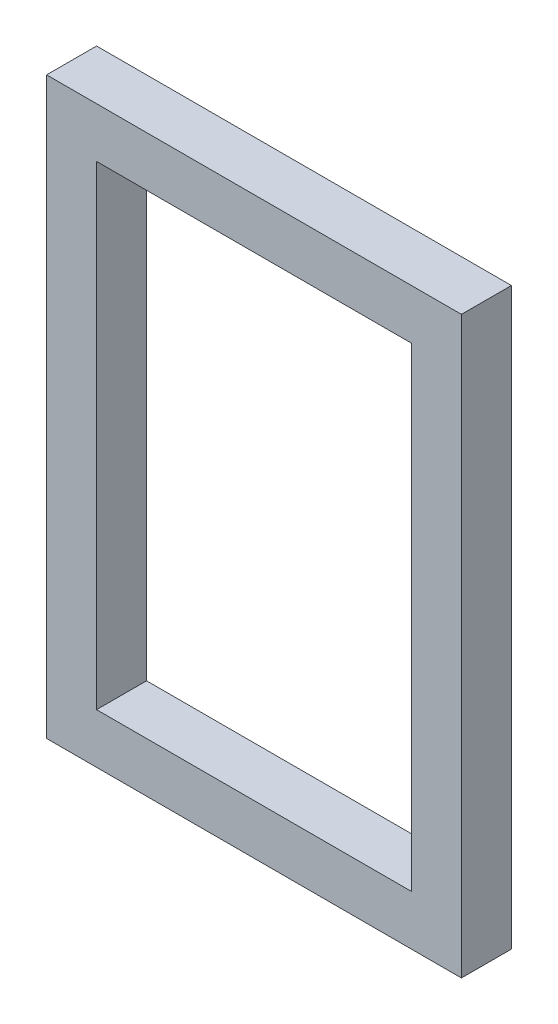
ISO-10303-21;
HEADER;
FILE_DESCRIPTION(('STEP AP214'),'2;1');
FILE_NAME('part.step','',(''),(''),'','','');
FILE_SCHEMA(('AUTOMOTIVE_DESIGN { 1 0 10303 214 1 1 1 1 }'));
ENDSEC;
DATA;
#1=APPLICATION_CONTEXT('core data for automotive mechanical design processes');
#2=APPLICATION_PROTOCOL_DEFINITION('international standard','automotive_design',2000,#1);
#3=PRODUCT_CONTEXT('',#1,'mechanical');
#4=PRODUCT('Part','Part','',(#3));
#5=PRODUCT_RELATED_PRODUCT_CATEGORY('part','',(#4));
#6=PRODUCT_DEFINITION_FORMATION('','',#4);
#7=PRODUCT_DEFINITION_CONTEXT('part definition',#1,'design');
#8=PRODUCT_DEFINITION('design','',#6,#7);
#9=PRODUCT_DEFINITION_SHAPE('','',#8);
#10=(LENGTH_UNIT() NAMED_UNIT(*) SI_UNIT(.MILLI.,.METRE.));
#11=(NAMED_UNIT(*) PLANE_ANGLE_UNIT() SI_UNIT($,.RADIAN.));
#12=(NAMED_UNIT(*) SI_UNIT($,.STERADIAN.) SOLID_ANGLE_UNIT());
#13=UNCERTAINTY_MEASURE_WITH_UNIT(LENGTH_MEASURE(1.E-05),#10,'distance_accuracy_value','');
#14=(GEOMETRIC_REPRESENTATION_CONTEXT(3) GLOBAL_UNCERTAINTY_ASSIGNED_CONTEXT((#13)) GLOBAL_UNIT_ASSIGNED_CONTEXT((#10,
#11,#12)) REPRESENTATION_CONTEXT('',''));
#15=CARTESIAN_POINT('',(0.,0.,0.));
#16=DIRECTION('',(0.,0.,1.));
#17=DIRECTION('',(1.,0.,0.));
#18=AXIS2_PLACEMENT_3D('',#15,#16,#17);
#19=CARTESIAN_POINT('',(10.541,-14.605,2.54));
#20=DIRECTION('',(-1.,0.,0.));
#21=DIRECTION('',(0.,0.,1.));
#22=AXIS2_PLACEMENT_3D('',#19,#20,#21);
#23=PLANE('',#22);
#24=DIRECTION('',(0.,1.,0.));
#25=VECTOR('',#24,1.);
#26=CARTESIAN_POINT('',(10.541,-14.605,0.));
#27=LINE('',#26,#25);
#28=CARTESIAN_POINT('',(10.541,-14.605,0.));
#29=VERTEX_POINT('',#28);
#30=CARTESIAN_POINT('',(10.541,14.605,0.));
#31=VERTEX_POINT('',#30);
#32=EDGE_CURVE('E153',#29,#31,#27,.T.);
#33=ORIENTED_EDGE('',*,*,#32,.T.);
#34=DIRECTION('',(0.,0.,-1.));
#35=VECTOR('',#34,1.);
#36=CARTESIAN_POINT('',(10.541,14.605,2.54));
#37=LINE('',#36,#35);
#38=CARTESIAN_POINT('',(10.541,14.605,2.54));
#39=VERTEX_POINT('',#38);
#40=EDGE_CURVE('E11',#39,#31,#37,.T.);
#41=ORIENTED_EDGE('',*,*,#40,.F.);
#42=DIRECTION('',(0.,1.,0.));
#43=VECTOR('',#42,1.);
#44=CARTESIAN_POINT('',(10.541,-14.605,2.54));
#45=LINE('',#44,#43);
#46=CARTESIAN_POINT('',(10.541,-14.605,2.54));
#47=VERTEX_POINT('',#46);
#48=EDGE_CURVE('E159',#47,#39,#45,.T.);
#49=ORIENTED_EDGE('',*,*,#48,.F.);
#50=DIRECTION('',(0.,0.,-1.));
#51=VECTOR('',#50,1.);
#52=CARTESIAN_POINT('',(10.541,-14.605,2.54));
#53=LINE('',#52,#51);
#54=EDGE_CURVE('E173',#47,#29,#53,.T.);
#55=ORIENTED_EDGE('',*,*,#54,.T.);
#56=EDGE_LOOP('',(#33,#41,#49,#55));
#57=FACE_BOUND('',#56,.T.);
#58=ADVANCED_FACE('F44',(#57),#23,.F.);
#59=CARTESIAN_POINT('',(-10.541,14.605,2.54));
#60=DIRECTION('',(0.,-1.,0.));
#61=DIRECTION('',(0.,0.,-1.));
#62=AXIS2_PLACEMENT_3D('',#59,#60,#61);
#63=PLANE('',#62);
#64=DIRECTION('',(-1.,0.,0.));
#65=VECTOR('',#64,1.);
#66=CARTESIAN_POINT('',(-10.541,14.605,0.));
#67=LINE('',#66,#65);
#68=CARTESIAN_POINT('',(-10.541,14.605,0.));
#69=VERTEX_POINT('',#68);
#70=EDGE_CURVE('E177',#31,#69,#67,.T.);
#71=ORIENTED_EDGE('',*,*,#70,.T.);
#72=DIRECTION('',(0.,0.,-1.));
#73=VECTOR('',#72,1.);
#74=CARTESIAN_POINT('',(-10.541,14.605,2.54));
#75=LINE('',#74,#73);
#76=CARTESIAN_POINT('',(-10.541,14.605,2.54));
#77=VERTEX_POINT('',#76);
#78=EDGE_CURVE('E52',#77,#69,#75,.T.);
#79=ORIENTED_EDGE('',*,*,#78,.F.);
#80=DIRECTION('',(-1.,0.,0.));
#81=VECTOR('',#80,1.);
#82=CARTESIAN_POINT('',(-10.541,14.605,2.54));
#83=LINE('',#82,#81);
#84=EDGE_CURVE('E163',#39,#77,#83,.T.);
#85=ORIENTED_EDGE('',*,*,#84,.F.);
#86=ORIENTED_EDGE('',*,*,#40,.T.);
#87=EDGE_LOOP('',(#71,#79,#85,#86));
#88=FACE_BOUND('',#87,.T.);
#89=ADVANCED_FACE('F212',(#88),#63,.F.);
#90=CARTESIAN_POINT('',(-10.541,-14.605,2.54));
#91=DIRECTION('',(1.,0.,0.));
#92=DIRECTION('',(0.,0.,-1.));
#93=AXIS2_PLACEMENT_3D('',#90,#91,#92);
#94=PLANE('',#93);
#95=DIRECTION('',(0.,-1.,0.));
#96=VECTOR('',#95,1.);
#97=CARTESIAN_POINT('',(-10.541,-14.605,0.));
#98=LINE('',#97,#96);
#99=CARTESIAN_POINT('',(-10.541,-14.605,0.));
#100=VERTEX_POINT('',#99);
#101=EDGE_CURVE('E180',#69,#100,#98,.T.);
#102=ORIENTED_EDGE('',*,*,#101,.T.);
#103=DIRECTION('',(0.,0.,-1.));
#104=VECTOR('',#103,1.);
#105=CARTESIAN_POINT('',(-10.541,-14.605,2.54));
#106=LINE('',#105,#104);
#107=CARTESIAN_POINT('',(-10.541,-14.605,2.54));
#108=VERTEX_POINT('',#107);
#109=EDGE_CURVE('E188',#108,#100,#106,.T.);
#110=ORIENTED_EDGE('',*,*,#109,.F.);
#111=DIRECTION('',(0.,-1.,0.));
#112=VECTOR('',#111,1.);
#113=CARTESIAN_POINT('',(-10.541,-14.605,2.54));
#114=LINE('',#113,#112);
#115=EDGE_CURVE('E167',#77,#108,#114,.T.);
#116=ORIENTED_EDGE('',*,*,#115,.F.);
#117=ORIENTED_EDGE('',*,*,#78,.T.);
#118=EDGE_LOOP('',(#102,#110,#116,#117));
#119=FACE_BOUND('',#118,.T.);
#120=ADVANCED_FACE('F198',(#119),#94,.F.);
#121=CARTESIAN_POINT('',(-10.541,-14.605,2.54));
#122=DIRECTION('',(0.,1.,0.));
#123=DIRECTION('',(0.,0.,1.));
#124=AXIS2_PLACEMENT_3D('',#121,#122,#123);
#125=PLANE('',#124);
#126=DIRECTION('',(1.,0.,0.));
#127=VECTOR('',#126,1.);
#128=CARTESIAN_POINT('',(-10.541,-14.605,0.));
#129=LINE('',#128,#127);
#130=EDGE_CURVE('E164',#100,#29,#129,.T.);
#131=ORIENTED_EDGE('',*,*,#130,.T.);
#132=ORIENTED_EDGE('',*,*,#54,.F.);
#133=DIRECTION('',(1.,0.,0.));
#134=VECTOR('',#133,1.);
#135=CARTESIAN_POINT('',(-10.541,-14.605,2.54));
#136=LINE('',#135,#134);
#137=EDGE_CURVE('E170',#108,#47,#136,.T.);
#138=ORIENTED_EDGE('',*,*,#137,.F.);
#139=ORIENTED_EDGE('',*,*,#109,.T.);
#140=EDGE_LOOP('',(#131,#132,#138,#139));
#141=FACE_BOUND('',#140,.T.);
#142=ADVANCED_FACE('F205',(#141),#125,.F.);
#143=CARTESIAN_POINT('',(0.,0.,2.54));
#144=DIRECTION('',(0.,0.,-1.));
#145=DIRECTION('',(-1.,0.,0.));
#146=AXIS2_PLACEMENT_3D('',#143,#144,#145);
#147=PLANE('',#146);
#148=DIRECTION('',(-1.,0.,0.));
#149=VECTOR('',#148,1.);
#150=CARTESIAN_POINT('',(-8.00100000000001,12.065,2.54));
#151=LINE('',#150,#149);
#152=CARTESIAN_POINT('',(8.001,12.065,2.54));
#153=VERTEX_POINT('',#152);
#154=CARTESIAN_POINT('',(-8.00100000000001,12.065,2.54));
#155=VERTEX_POINT('',#154);
#156=EDGE_CURVE('E144',#153,#155,#151,.T.);
#157=ORIENTED_EDGE('',*,*,#156,.F.);
#158=DIRECTION('',(0.,1.,0.));
#159=VECTOR('',#158,1.);
#160=CARTESIAN_POINT('',(8.001,-12.065,2.54));
#161=LINE('',#160,#159);
#162=CARTESIAN_POINT('',(8.001,-12.065,2.54));
#163=VERTEX_POINT('',#162);
#164=EDGE_CURVE('E59',#163,#153,#161,.T.);
#165=ORIENTED_EDGE('',*,*,#164,.F.);
#166=DIRECTION('',(1.,0.,0.));
#167=VECTOR('',#166,1.);
#168=CARTESIAN_POINT('',(-8.00100000000001,-12.065,2.54));
#169=LINE('',#168,#167);
#170=CARTESIAN_POINT('',(-8.00100000000001,-12.065,2.54));
#171=VERTEX_POINT('',#170);
#172=EDGE_CURVE('E130',#171,#163,#169,.T.);
#173=ORIENTED_EDGE('',*,*,#172,.F.);
#174=DIRECTION('',(0.,-1.,0.));
#175=VECTOR('',#174,1.);
#176=CARTESIAN_POINT('',(-8.00100000000001,-12.065,2.54));
#177=LINE('',#176,#175);
#178=EDGE_CURVE('E135',#155,#171,#177,.T.);
#179=ORIENTED_EDGE('',*,*,#178,.F.);
#180=EDGE_LOOP('',(#157,#165,#173,#179));
#181=FACE_BOUND('',#180,.T.);
#182=ORIENTED_EDGE('',*,*,#48,.T.);
#183=ORIENTED_EDGE('',*,*,#84,.T.);
#184=ORIENTED_EDGE('',*,*,#115,.T.);
#185=ORIENTED_EDGE('',*,*,#137,.T.);
#186=EDGE_LOOP('',(#182,#183,#184,#185));
#187=FACE_BOUND('',#186,.T.);
#188=ADVANCED_FACE('F211',(#181,#187),#147,.F.);
#189=CARTESIAN_POINT('',(0.,0.,0.));
#190=DIRECTION('',(0.,0.,-1.));
#191=DIRECTION('',(-1.,0.,0.));
#192=AXIS2_PLACEMENT_3D('',#189,#190,#191);
#193=PLANE('',#192);
#194=DIRECTION('',(0.,1.,0.));
#195=VECTOR('',#194,1.);
#196=CARTESIAN_POINT('',(8.001,-12.065,0.));
#197=LINE('',#196,#195);
#198=CARTESIAN_POINT('',(8.001,-12.065,0.));
#199=VERTEX_POINT('',#198);
#200=CARTESIAN_POINT('',(8.001,12.065,0.));
#201=VERTEX_POINT('',#200);
#202=EDGE_CURVE('E111',#199,#201,#197,.T.);
#203=ORIENTED_EDGE('',*,*,#202,.T.);
#204=DIRECTION('',(-1.,0.,0.));
#205=VECTOR('',#204,1.);
#206=CARTESIAN_POINT('',(-8.00100000000001,12.065,0.));
#207=LINE('',#206,#205);
#208=CARTESIAN_POINT('',(-8.00100000000001,12.065,0.));
#209=VERTEX_POINT('',#208);
#210=EDGE_CURVE('E121',#201,#209,#207,.T.);
#211=ORIENTED_EDGE('',*,*,#210,.T.);
#212=DIRECTION('',(0.,-1.,0.));
#213=VECTOR('',#212,1.);
#214=CARTESIAN_POINT('',(-8.00100000000001,-12.065,0.));
#215=LINE('',#214,#213);
#216=CARTESIAN_POINT('',(-8.00100000000001,-12.065,0.));
#217=VERTEX_POINT('',#216);
#218=EDGE_CURVE('E67',#209,#217,#215,.T.);
#219=ORIENTED_EDGE('',*,*,#218,.T.);
#220=DIRECTION('',(1.,0.,0.));
#221=VECTOR('',#220,1.);
#222=CARTESIAN_POINT('',(-8.00100000000001,-12.065,0.));
#223=LINE('',#222,#221);
#224=EDGE_CURVE('E118',#217,#199,#223,.T.);
#225=ORIENTED_EDGE('',*,*,#224,.T.);
#226=EDGE_LOOP('',(#203,#211,#219,#225));
#227=FACE_BOUND('',#226,.T.);
#228=ORIENTED_EDGE('',*,*,#32,.F.);
#229=ORIENTED_EDGE('',*,*,#130,.F.);
#230=ORIENTED_EDGE('',*,*,#101,.F.);
#231=ORIENTED_EDGE('',*,*,#70,.F.);
#232=EDGE_LOOP('',(#228,#229,#230,#231));
#233=FACE_BOUND('',#232,.T.);
#234=ADVANCED_FACE('F126',(#227,#233),#193,.T.);
#235=CARTESIAN_POINT('',(8.001,-12.065,0.));
#236=DIRECTION('',(1.,0.,0.));
#237=DIRECTION('',(0.,0.,-1.));
#238=AXIS2_PLACEMENT_3D('',#235,#236,#237);
#239=PLANE('',#238);
#240=ORIENTED_EDGE('',*,*,#164,.T.);
#241=DIRECTION('',(0.,0.,1.));
#242=VECTOR('',#241,1.);
#243=CARTESIAN_POINT('',(8.001,12.065,0.));
#244=LINE('',#243,#242);
#245=EDGE_CURVE('E107',#201,#153,#244,.T.);
#246=ORIENTED_EDGE('',*,*,#245,.F.);
#247=ORIENTED_EDGE('',*,*,#202,.F.);
#248=DIRECTION('',(0.,0.,1.));
#249=VECTOR('',#248,1.);
#250=CARTESIAN_POINT('',(8.001,-12.065,0.));
#251=LINE('',#250,#249);
#252=EDGE_CURVE('E150',#199,#163,#251,.T.);
#253=ORIENTED_EDGE('',*,*,#252,.T.);
#254=EDGE_LOOP('',(#240,#246,#247,#253));
#255=FACE_BOUND('',#254,.T.);
#256=ADVANCED_FACE('F109',(#255),#239,.F.);
#257=CARTESIAN_POINT('',(-8.00100000000001,-12.065,0.));
#258=DIRECTION('',(0.,-1.,0.));
#259=DIRECTION('',(0.,0.,-1.));
#260=AXIS2_PLACEMENT_3D('',#257,#258,#259);
#261=PLANE('',#260);
#262=ORIENTED_EDGE('',*,*,#172,.T.);
#263=ORIENTED_EDGE('',*,*,#252,.F.);
#264=ORIENTED_EDGE('',*,*,#224,.F.);
#265=DIRECTION('',(0.,0.,1.));
#266=VECTOR('',#265,1.);
#267=CARTESIAN_POINT('',(-8.00100000000001,-12.065,0.));
#268=LINE('',#267,#266);
#269=EDGE_CURVE('E154',#217,#171,#268,.T.);
#270=ORIENTED_EDGE('',*,*,#269,.T.);
#271=EDGE_LOOP('',(#262,#263,#264,#270));
#272=FACE_BOUND('',#271,.T.);
#273=ADVANCED_FACE('F229',(#272),#261,.F.);
#274=CARTESIAN_POINT('',(-8.00100000000001,-12.065,0.));
#275=DIRECTION('',(-1.,0.,0.));
#276=DIRECTION('',(0.,0.,1.));
#277=AXIS2_PLACEMENT_3D('',#274,#275,#276);
#278=PLANE('',#277);
#279=ORIENTED_EDGE('',*,*,#178,.T.);
#280=ORIENTED_EDGE('',*,*,#269,.F.);
#281=ORIENTED_EDGE('',*,*,#218,.F.);
#282=DIRECTION('',(0.,0.,1.));
#283=VECTOR('',#282,1.);
#284=CARTESIAN_POINT('',(-8.00100000000001,12.065,0.));
#285=LINE('',#284,#283);
#286=EDGE_CURVE('E117',#209,#155,#285,.T.);
#287=ORIENTED_EDGE('',*,*,#286,.T.);
#288=EDGE_LOOP('',(#279,#280,#281,#287));
#289=FACE_BOUND('',#288,.T.);
#290=ADVANCED_FACE('F232',(#289),#278,.F.);
#291=CARTESIAN_POINT('',(-8.00100000000001,12.065,0.));
#292=DIRECTION('',(0.,1.,0.));
#293=DIRECTION('',(0.,0.,1.));
#294=AXIS2_PLACEMENT_3D('',#291,#292,#293);
#295=PLANE('',#294);
#296=ORIENTED_EDGE('',*,*,#156,.T.);
#297=ORIENTED_EDGE('',*,*,#286,.F.);
#298=ORIENTED_EDGE('',*,*,#210,.F.);
#299=ORIENTED_EDGE('',*,*,#245,.T.);
#300=EDGE_LOOP('',(#296,#297,#298,#299));
#301=FACE_BOUND('',#300,.T.);
#302=ADVANCED_FACE('F122',(#301),#295,.F.);
#303=CLOSED_SHELL('',(#58,#89,#120,#142,#188,#234,#256,#273,#290,#302));
#304=MANIFOLD_SOLID_BREP('B2',#303);
#305=ADVANCED_BREP_SHAPE_REPRESENTATION('',(#18,#304),#14);
#306=SHAPE_DEFINITION_REPRESENTATION(#9,#305);
ENDSEC;
END-ISO-10303-21;
